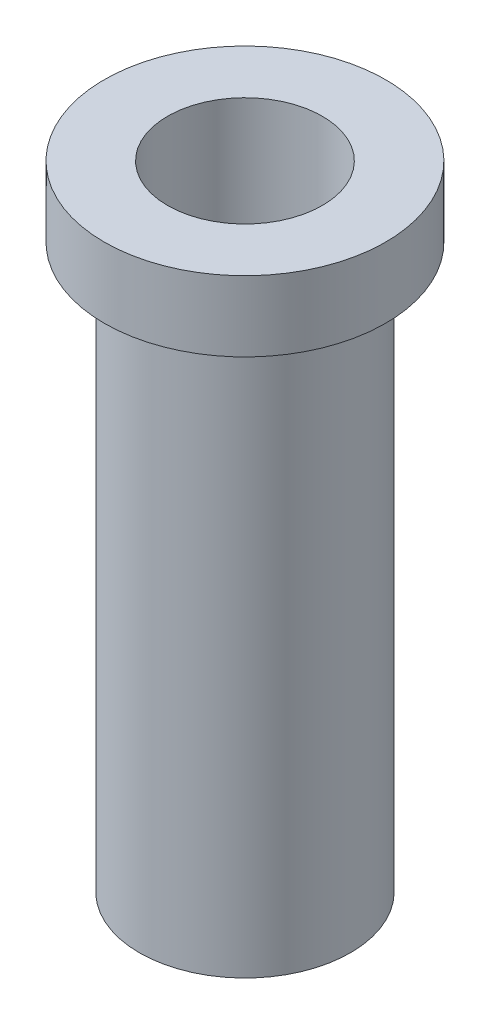
ISO-10303-21;
HEADER;
FILE_DESCRIPTION(('STEP AP214'),'2;1');
FILE_NAME('part.step','',(''),(''),'','','');
FILE_SCHEMA(('AUTOMOTIVE_DESIGN { 1 0 10303 214 1 1 1 1 }'));
ENDSEC;
DATA;
#1=APPLICATION_CONTEXT('core data for automotive mechanical design processes');
#2=APPLICATION_PROTOCOL_DEFINITION('international standard','automotive_design',2000,#1);
#3=PRODUCT_CONTEXT('',#1,'mechanical');
#4=PRODUCT('Part','Part','',(#3));
#5=PRODUCT_RELATED_PRODUCT_CATEGORY('part','',(#4));
#6=PRODUCT_DEFINITION_FORMATION('','',#4);
#7=PRODUCT_DEFINITION_CONTEXT('part definition',#1,'design');
#8=PRODUCT_DEFINITION('design','',#6,#7);
#9=PRODUCT_DEFINITION_SHAPE('','',#8);
#10=(LENGTH_UNIT() NAMED_UNIT(*) SI_UNIT(.MILLI.,.METRE.));
#11=(NAMED_UNIT(*) PLANE_ANGLE_UNIT() SI_UNIT($,.RADIAN.));
#12=(NAMED_UNIT(*) SI_UNIT($,.STERADIAN.) SOLID_ANGLE_UNIT());
#13=UNCERTAINTY_MEASURE_WITH_UNIT(LENGTH_MEASURE(1.E-05),#10,'distance_accuracy_value','');
#14=(GEOMETRIC_REPRESENTATION_CONTEXT(3) GLOBAL_UNCERTAINTY_ASSIGNED_CONTEXT((#13)) GLOBAL_UNIT_ASSIGNED_CONTEXT((#10,
#11,#12)) REPRESENTATION_CONTEXT('',''));
#15=CARTESIAN_POINT('',(0.,0.,0.));
#16=DIRECTION('',(0.,0.,1.));
#17=DIRECTION('',(1.,0.,0.));
#18=AXIS2_PLACEMENT_3D('',#15,#16,#17);
#19=CARTESIAN_POINT('',(0.,40.,0.));
#20=DIRECTION('',(0.,-1.,0.));
#21=DIRECTION('',(0.,0.,-1.));
#22=AXIS2_PLACEMENT_3D('',#19,#20,#21);
#23=CYLINDRICAL_SURFACE('',#22,7.5);
#24=CARTESIAN_POINT('',(0.,40.,0.));
#25=DIRECTION('',(0.,1.,0.));
#26=DIRECTION('',(0.,0.,1.));
#27=AXIS2_PLACEMENT_3D('',#24,#25,#26);
#28=CIRCLE('',#27,7.5);
#29=CARTESIAN_POINT('',(0.,40.,7.5));
#30=VERTEX_POINT('',#29);
#31=EDGE_CURVE('E10',#30,#30,#28,.T.);
#32=ORIENTED_EDGE('',*,*,#31,.F.);
#33=EDGE_LOOP('',(#32));
#34=FACE_BOUND('',#33,.T.);
#35=CARTESIAN_POINT('',(0.,0.,0.));
#36=DIRECTION('',(0.,1.,0.));
#37=DIRECTION('',(0.,0.,1.));
#38=AXIS2_PLACEMENT_3D('',#35,#36,#37);
#39=CIRCLE('',#38,7.5);
#40=CARTESIAN_POINT('',(0.,0.,7.5));
#41=VERTEX_POINT('',#40);
#42=EDGE_CURVE('E38',#41,#41,#39,.T.);
#43=ORIENTED_EDGE('',*,*,#42,.T.);
#44=EDGE_LOOP('',(#43));
#45=FACE_BOUND('',#44,.T.);
#46=ADVANCED_FACE('F35',(#34,#45),#23,.T.);
#47=CARTESIAN_POINT('',(0.,0.,0.));
#48=DIRECTION('',(0.,1.,0.));
#49=DIRECTION('',(0.,0.,1.));
#50=AXIS2_PLACEMENT_3D('',#47,#48,#49);
#51=PLANE('',#50);
#52=CARTESIAN_POINT('',(0.,0.,0.));
#53=DIRECTION('',(0.,1.,0.));
#54=DIRECTION('',(0.,0.,1.));
#55=AXIS2_PLACEMENT_3D('',#52,#53,#54);
#56=CIRCLE('',#55,5.5);
#57=CARTESIAN_POINT('',(0.,0.,5.5));
#58=VERTEX_POINT('',#57);
#59=EDGE_CURVE('E50',#58,#58,#56,.F.);
#60=ORIENTED_EDGE('',*,*,#59,.F.);
#61=EDGE_LOOP('',(#60));
#62=FACE_BOUND('',#61,.T.);
#63=ORIENTED_EDGE('',*,*,#42,.F.);
#64=EDGE_LOOP('',(#63));
#65=FACE_BOUND('',#64,.T.);
#66=ADVANCED_FACE('F72',(#62,#65),#51,.F.);
#67=CARTESIAN_POINT('',(0.,45.,0.));
#68=DIRECTION('',(0.,-1.,0.));
#69=DIRECTION('',(0.,0.,-1.));
#70=AXIS2_PLACEMENT_3D('',#67,#68,#69);
#71=CYLINDRICAL_SURFACE('',#70,10.);
#72=CARTESIAN_POINT('',(0.,45.,0.));
#73=DIRECTION('',(0.,1.,0.));
#74=DIRECTION('',(0.,0.,1.));
#75=AXIS2_PLACEMENT_3D('',#72,#73,#74);
#76=CIRCLE('',#75,10.);
#77=CARTESIAN_POINT('',(0.,45.,10.));
#78=VERTEX_POINT('',#77);
#79=EDGE_CURVE('E45',#78,#78,#76,.T.);
#80=ORIENTED_EDGE('',*,*,#79,.F.);
#81=EDGE_LOOP('',(#80));
#82=FACE_BOUND('',#81,.T.);
#83=CARTESIAN_POINT('',(0.,40.,0.));
#84=DIRECTION('',(0.,1.,0.));
#85=DIRECTION('',(0.,0.,1.));
#86=AXIS2_PLACEMENT_3D('',#83,#84,#85);
#87=CIRCLE('',#86,10.);
#88=CARTESIAN_POINT('',(0.,40.,10.));
#89=VERTEX_POINT('',#88);
#90=EDGE_CURVE('E47',#89,#89,#87,.T.);
#91=ORIENTED_EDGE('',*,*,#90,.T.);
#92=EDGE_LOOP('',(#91));
#93=FACE_BOUND('',#92,.T.);
#94=ADVANCED_FACE('F66',(#82,#93),#71,.T.);
#95=CARTESIAN_POINT('',(0.,45.,0.));
#96=DIRECTION('',(0.,1.,0.));
#97=DIRECTION('',(0.,0.,1.));
#98=AXIS2_PLACEMENT_3D('',#95,#96,#97);
#99=PLANE('',#98);
#100=CARTESIAN_POINT('',(0.,45.,0.));
#101=DIRECTION('',(0.,1.,0.));
#102=DIRECTION('',(0.,0.,1.));
#103=AXIS2_PLACEMENT_3D('',#100,#101,#102);
#104=CIRCLE('',#103,5.5);
#105=CARTESIAN_POINT('',(0.,45.,5.5));
#106=VERTEX_POINT('',#105);
#107=EDGE_CURVE('E55',#106,#106,#104,.T.);
#108=ORIENTED_EDGE('',*,*,#107,.F.);
#109=EDGE_LOOP('',(#108));
#110=FACE_BOUND('',#109,.T.);
#111=ORIENTED_EDGE('',*,*,#79,.T.);
#112=EDGE_LOOP('',(#111));
#113=FACE_BOUND('',#112,.T.);
#114=ADVANCED_FACE('F62',(#110,#113),#99,.T.);
#115=CARTESIAN_POINT('',(0.,40.,0.));
#116=DIRECTION('',(0.,1.,0.));
#117=DIRECTION('',(0.,0.,1.));
#118=AXIS2_PLACEMENT_3D('',#115,#116,#117);
#119=PLANE('',#118);
#120=ORIENTED_EDGE('',*,*,#31,.T.);
#121=EDGE_LOOP('',(#120));
#122=FACE_BOUND('',#121,.T.);
#123=ORIENTED_EDGE('',*,*,#90,.F.);
#124=EDGE_LOOP('',(#123));
#125=FACE_BOUND('',#124,.T.);
#126=ADVANCED_FACE('F65',(#122,#125),#119,.F.);
#127=CARTESIAN_POINT('',(0.,-0.001000000000001,0.));
#128=DIRECTION('',(0.,1.,0.));
#129=DIRECTION('',(0.,0.,1.));
#130=AXIS2_PLACEMENT_3D('',#127,#128,#129);
#131=CYLINDRICAL_SURFACE('',#130,5.5);
#132=ORIENTED_EDGE('',*,*,#107,.T.);
#133=EDGE_LOOP('',(#132));
#134=FACE_BOUND('',#133,.T.);
#135=ORIENTED_EDGE('',*,*,#59,.T.);
#136=EDGE_LOOP('',(#135));
#137=FACE_BOUND('',#136,.T.);
#138=ADVANCED_FACE('F59',(#134,#137),#131,.F.);
#139=CLOSED_SHELL('',(#46,#66,#94,#114,#126,#138));
#140=MANIFOLD_SOLID_BREP('B2',#139);
#141=ADVANCED_BREP_SHAPE_REPRESENTATION('',(#18,#140),#14);
#142=SHAPE_DEFINITION_REPRESENTATION(#9,#141);
ENDSEC;
END-ISO-10303-21;
